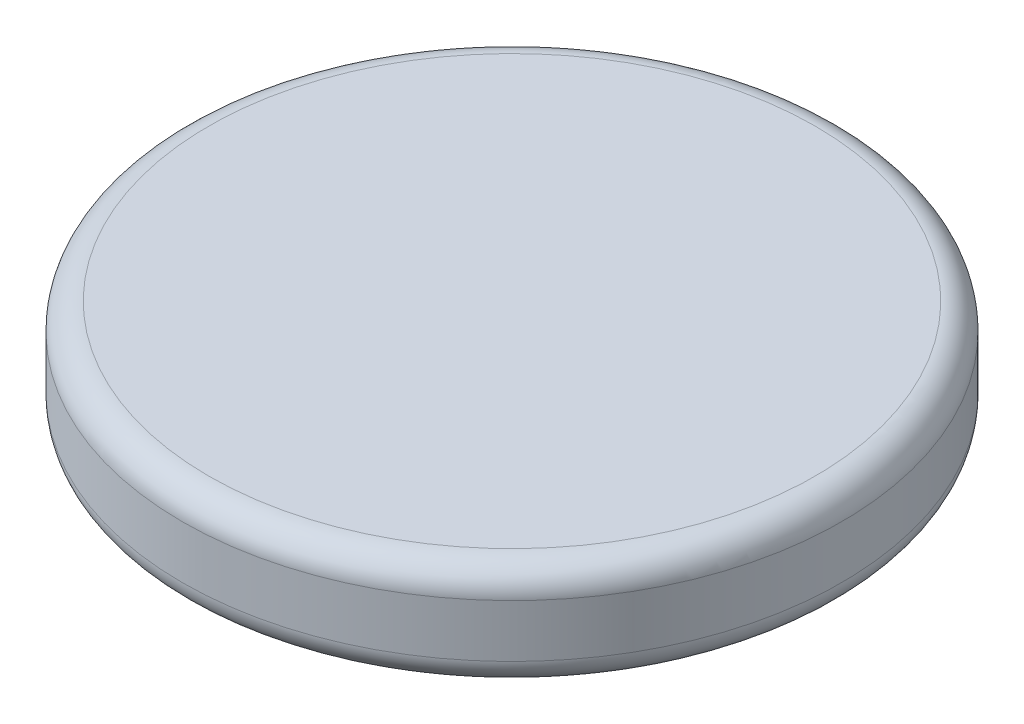
ISO-10303-21;
HEADER;
FILE_DESCRIPTION(('STEP AP214'),'2;1');
FILE_NAME('part.step','',(''),(''),'','','');
FILE_SCHEMA(('AUTOMOTIVE_DESIGN { 1 0 10303 214 1 1 1 1 }'));
ENDSEC;
DATA;
#1=APPLICATION_CONTEXT('core data for automotive mechanical design processes');
#2=APPLICATION_PROTOCOL_DEFINITION('international standard','automotive_design',2000,#1);
#3=PRODUCT_CONTEXT('',#1,'mechanical');
#4=PRODUCT('Part','Part','',(#3));
#5=PRODUCT_RELATED_PRODUCT_CATEGORY('part','',(#4));
#6=PRODUCT_DEFINITION_FORMATION('','',#4);
#7=PRODUCT_DEFINITION_CONTEXT('part definition',#1,'design');
#8=PRODUCT_DEFINITION('design','',#6,#7);
#9=PRODUCT_DEFINITION_SHAPE('','',#8);
#10=(LENGTH_UNIT() NAMED_UNIT(*) SI_UNIT(.MILLI.,.METRE.));
#11=(NAMED_UNIT(*) PLANE_ANGLE_UNIT() SI_UNIT($,.RADIAN.));
#12=(NAMED_UNIT(*) SI_UNIT($,.STERADIAN.) SOLID_ANGLE_UNIT());
#13=UNCERTAINTY_MEASURE_WITH_UNIT(LENGTH_MEASURE(1.E-05),#10,'distance_accuracy_value','');
#14=(GEOMETRIC_REPRESENTATION_CONTEXT(3) GLOBAL_UNCERTAINTY_ASSIGNED_CONTEXT((#13)) GLOBAL_UNIT_ASSIGNED_CONTEXT((#10,
#11,#12)) REPRESENTATION_CONTEXT('',''));
#15=CARTESIAN_POINT('',(0.,0.,0.));
#16=DIRECTION('',(0.,0.,1.));
#17=DIRECTION('',(1.,0.,0.));
#18=AXIS2_PLACEMENT_3D('',#15,#16,#17);
#19=CARTESIAN_POINT('',(0.,-1.2,0.));
#20=DIRECTION('',(0.,1.,0.));
#21=DIRECTION('',(0.,0.,1.));
#22=AXIS2_PLACEMENT_3D('',#19,#20,#21);
#23=PLANE('',#22);
#24=CARTESIAN_POINT('',(0.,-1.2,0.));
#25=DIRECTION('',(0.,1.,0.));
#26=DIRECTION('',(0.,0.,1.));
#27=AXIS2_PLACEMENT_3D('',#24,#25,#26);
#28=CIRCLE('',#27,11.3);
#29=CARTESIAN_POINT('',(0.,-1.2,11.3));
#30=VERTEX_POINT('',#29);
#31=EDGE_CURVE('E250',#30,#30,#28,.T.);
#32=ORIENTED_EDGE('',*,*,#31,.F.);
#33=EDGE_LOOP('',(#32));
#34=FACE_BOUND('',#33,.T.);
#35=DIRECTION('',(0.,0.,-1.));
#36=VECTOR('',#35,1.);
#37=CARTESIAN_POINT('',(-3.1,-1.2,0.));
#38=LINE('',#37,#36);
#39=CARTESIAN_POINT('',(-3.1,-1.2,3.1));
#40=VERTEX_POINT('',#39);
#41=CARTESIAN_POINT('',(-3.1,-1.2,-3.1));
#42=VERTEX_POINT('',#41);
#43=EDGE_CURVE('E260',#40,#42,#38,.T.);
#44=ORIENTED_EDGE('',*,*,#43,.F.);
#45=DIRECTION('',(-1.,0.,0.));
#46=VECTOR('',#45,1.);
#47=CARTESIAN_POINT('',(0.,-1.2,3.1));
#48=LINE('',#47,#46);
#49=CARTESIAN_POINT('',(3.1,-1.2,3.1));
#50=VERTEX_POINT('',#49);
#51=EDGE_CURVE('E253',#50,#40,#48,.T.);
#52=ORIENTED_EDGE('',*,*,#51,.F.);
#53=DIRECTION('',(0.,0.,-1.));
#54=VECTOR('',#53,1.);
#55=CARTESIAN_POINT('',(3.1,-1.2,0.));
#56=LINE('',#55,#54);
#57=CARTESIAN_POINT('',(3.1,-1.2,-3.1));
#58=VERTEX_POINT('',#57);
#59=EDGE_CURVE('E256',#50,#58,#56,.T.);
#60=ORIENTED_EDGE('',*,*,#59,.T.);
#61=DIRECTION('',(-1.,0.,0.));
#62=VECTOR('',#61,1.);
#63=CARTESIAN_POINT('',(0.,-1.2,-3.1));
#64=LINE('',#63,#62);
#65=EDGE_CURVE('E258',#58,#42,#64,.T.);
#66=ORIENTED_EDGE('',*,*,#65,.T.);
#67=EDGE_LOOP('',(#44,#52,#60,#66));
#68=FACE_BOUND('',#67,.T.);
#69=ADVANCED_FACE('F63',(#34,#68),#23,.F.);
#70=CARTESIAN_POINT('',(0.,-1.2,0.));
#71=DIRECTION('',(0.,1.,0.));
#72=DIRECTION('',(0.,0.,1.));
#73=AXIS2_PLACEMENT_3D('',#70,#71,#72);
#74=CYLINDRICAL_SURFACE('',#73,12.5);
#75=CARTESIAN_POINT('',(0.,-3.,0.));
#76=DIRECTION('',(0.,1.,0.));
#77=DIRECTION('',(0.,0.,1.));
#78=AXIS2_PLACEMENT_3D('',#75,#76,#77);
#79=CIRCLE('',#78,12.5);
#80=CARTESIAN_POINT('',(0.,-3.,12.5));
#81=VERTEX_POINT('',#80);
#82=EDGE_CURVE('E266',#81,#81,#79,.T.);
#83=ORIENTED_EDGE('',*,*,#82,.T.);
#84=EDGE_LOOP('',(#83));
#85=FACE_BOUND('',#84,.T.);
#86=CARTESIAN_POINT('',(0.,-1.,0.));
#87=DIRECTION('',(0.,1.,0.));
#88=DIRECTION('',(0.,0.,1.));
#89=AXIS2_PLACEMENT_3D('',#86,#87,#88);
#90=CIRCLE('',#89,12.5);
#91=CARTESIAN_POINT('',(0.,-1.,12.5));
#92=VERTEX_POINT('',#91);
#93=EDGE_CURVE('E263',#92,#92,#90,.F.);
#94=ORIENTED_EDGE('',*,*,#93,.T.);
#95=EDGE_LOOP('',(#94));
#96=FACE_BOUND('',#95,.T.);
#97=ADVANCED_FACE('F280',(#85,#96),#74,.T.);
#98=CARTESIAN_POINT('',(0.,0.,0.));
#99=DIRECTION('',(0.,1.,0.));
#100=DIRECTION('',(0.,0.,1.));
#101=AXIS2_PLACEMENT_3D('',#98,#99,#100);
#102=PLANE('',#101);
#103=CARTESIAN_POINT('',(0.,0.,0.));
#104=DIRECTION('',(0.,1.,0.));
#105=DIRECTION('',(0.,0.,1.));
#106=AXIS2_PLACEMENT_3D('',#103,#104,#105);
#107=CIRCLE('',#106,11.5);
#108=CARTESIAN_POINT('',(0.,0.,11.5));
#109=VERTEX_POINT('',#108);
#110=EDGE_CURVE('E12',#109,#109,#107,.T.);
#111=ORIENTED_EDGE('',*,*,#110,.T.);
#112=EDGE_LOOP('',(#111));
#113=FACE_BOUND('',#112,.T.);
#114=ADVANCED_FACE('F283',(#113),#102,.T.);
#115=CARTESIAN_POINT('',(0.,-4.,0.));
#116=DIRECTION('',(0.,1.,0.));
#117=DIRECTION('',(0.,0.,1.));
#118=AXIS2_PLACEMENT_3D('',#115,#116,#117);
#119=CYLINDRICAL_SURFACE('',#118,11.3);
#120=CARTESIAN_POINT('',(0.,-4.,0.));
#121=DIRECTION('',(0.,1.,0.));
#122=DIRECTION('',(0.,0.,1.));
#123=AXIS2_PLACEMENT_3D('',#120,#121,#122);
#124=CIRCLE('',#123,11.3);
#125=CARTESIAN_POINT('',(0.,-4.,11.3));
#126=VERTEX_POINT('',#125);
#127=EDGE_CURVE('E239',#126,#126,#124,.T.);
#128=ORIENTED_EDGE('',*,*,#127,.F.);
#129=EDGE_LOOP('',(#128));
#130=FACE_BOUND('',#129,.T.);
#131=ORIENTED_EDGE('',*,*,#31,.T.);
#132=EDGE_LOOP('',(#131));
#133=FACE_BOUND('',#132,.T.);
#134=ADVANCED_FACE('F292',(#130,#133),#119,.F.);
#135=CARTESIAN_POINT('',(0.,-4.,0.));
#136=DIRECTION('',(0.,1.,0.));
#137=DIRECTION('',(0.,0.,1.));
#138=AXIS2_PLACEMENT_3D('',#135,#136,#137);
#139=PLANE('',#138);
#140=CARTESIAN_POINT('',(0.,-4.,0.));
#141=DIRECTION('',(0.,1.,0.));
#142=DIRECTION('',(0.,0.,1.));
#143=AXIS2_PLACEMENT_3D('',#140,#141,#142);
#144=CIRCLE('',#143,11.5);
#145=CARTESIAN_POINT('',(0.,-4.,11.5));
#146=VERTEX_POINT('',#145);
#147=EDGE_CURVE('E71',#146,#146,#144,.F.);
#148=ORIENTED_EDGE('',*,*,#147,.T.);
#149=EDGE_LOOP('',(#148));
#150=FACE_BOUND('',#149,.T.);
#151=ORIENTED_EDGE('',*,*,#127,.T.);
#152=EDGE_LOOP('',(#151));
#153=FACE_BOUND('',#152,.T.);
#154=ADVANCED_FACE('F271',(#150,#153),#139,.F.);
#155=CARTESIAN_POINT('',(-3.1,-2.,0.));
#156=DIRECTION('',(1.,0.,0.));
#157=DIRECTION('',(0.,0.,-1.));
#158=AXIS2_PLACEMENT_3D('',#155,#156,#157);
#159=PLANE('',#158);
#160=DIRECTION('',(0.,1.,0.));
#161=VECTOR('',#160,1.);
#162=CARTESIAN_POINT('',(-3.1,-2.,3.1));
#163=LINE('',#162,#161);
#164=CARTESIAN_POINT('',(-3.1,-5.,3.1));
#165=VERTEX_POINT('',#164);
#166=EDGE_CURVE('E235',#165,#40,#163,.T.);
#167=ORIENTED_EDGE('',*,*,#166,.T.);
#168=ORIENTED_EDGE('',*,*,#43,.T.);
#169=DIRECTION('',(0.,1.,0.));
#170=VECTOR('',#169,1.);
#171=CARTESIAN_POINT('',(-3.1,-2.,-3.1));
#172=LINE('',#171,#170);
#173=CARTESIAN_POINT('',(-3.1,-5.,-3.1));
#174=VERTEX_POINT('',#173);
#175=EDGE_CURVE('E236',#174,#42,#172,.T.);
#176=ORIENTED_EDGE('',*,*,#175,.F.);
#177=DIRECTION('',(0.,0.,-1.));
#178=VECTOR('',#177,1.);
#179=CARTESIAN_POINT('',(-3.1,-5.,0.));
#180=LINE('',#179,#178);
#181=EDGE_CURVE('E226',#165,#174,#180,.T.);
#182=ORIENTED_EDGE('',*,*,#181,.F.);
#183=EDGE_LOOP('',(#167,#168,#176,#182));
#184=FACE_BOUND('',#183,.T.);
#185=ADVANCED_FACE('F309',(#184),#159,.F.);
#186=CARTESIAN_POINT('',(0.,-2.,-3.1));
#187=DIRECTION('',(0.,0.,-1.));
#188=DIRECTION('',(-1.,0.,0.));
#189=AXIS2_PLACEMENT_3D('',#186,#187,#188);
#190=PLANE('',#189);
#191=ORIENTED_EDGE('',*,*,#65,.F.);
#192=DIRECTION('',(0.,1.,0.));
#193=VECTOR('',#192,1.);
#194=CARTESIAN_POINT('',(3.1,-2.,-3.1));
#195=LINE('',#194,#193);
#196=CARTESIAN_POINT('',(3.1,-5.,-3.1));
#197=VERTEX_POINT('',#196);
#198=EDGE_CURVE('E240',#197,#58,#195,.T.);
#199=ORIENTED_EDGE('',*,*,#198,.F.);
#200=DIRECTION('',(-1.,0.,0.));
#201=VECTOR('',#200,1.);
#202=CARTESIAN_POINT('',(0.,-5.,-3.1));
#203=LINE('',#202,#201);
#204=EDGE_CURVE('E218',#197,#174,#203,.T.);
#205=ORIENTED_EDGE('',*,*,#204,.T.);
#206=ORIENTED_EDGE('',*,*,#175,.T.);
#207=EDGE_LOOP('',(#191,#199,#205,#206));
#208=FACE_BOUND('',#207,.T.);
#209=ADVANCED_FACE('F312',(#208),#190,.T.);
#210=CARTESIAN_POINT('',(3.1,-2.,0.));
#211=DIRECTION('',(1.,0.,0.));
#212=DIRECTION('',(0.,0.,-1.));
#213=AXIS2_PLACEMENT_3D('',#210,#211,#212);
#214=PLANE('',#213);
#215=ORIENTED_EDGE('',*,*,#59,.F.);
#216=DIRECTION('',(0.,1.,0.));
#217=VECTOR('',#216,1.);
#218=CARTESIAN_POINT('',(3.1,-2.,3.1));
#219=LINE('',#218,#217);
#220=CARTESIAN_POINT('',(3.1,-5.,3.1));
#221=VERTEX_POINT('',#220);
#222=EDGE_CURVE('E243',#221,#50,#219,.T.);
#223=ORIENTED_EDGE('',*,*,#222,.F.);
#224=DIRECTION('',(0.,0.,-1.));
#225=VECTOR('',#224,1.);
#226=CARTESIAN_POINT('',(3.1,-5.,0.));
#227=LINE('',#226,#225);
#228=EDGE_CURVE('E232',#221,#197,#227,.T.);
#229=ORIENTED_EDGE('',*,*,#228,.T.);
#230=ORIENTED_EDGE('',*,*,#198,.T.);
#231=EDGE_LOOP('',(#215,#223,#229,#230));
#232=FACE_BOUND('',#231,.T.);
#233=ADVANCED_FACE('F317',(#232),#214,.T.);
#234=CARTESIAN_POINT('',(0.,-2.,3.1));
#235=DIRECTION('',(0.,0.,-1.));
#236=DIRECTION('',(-1.,0.,0.));
#237=AXIS2_PLACEMENT_3D('',#234,#235,#236);
#238=PLANE('',#237);
#239=ORIENTED_EDGE('',*,*,#222,.T.);
#240=ORIENTED_EDGE('',*,*,#51,.T.);
#241=ORIENTED_EDGE('',*,*,#166,.F.);
#242=DIRECTION('',(-1.,0.,0.));
#243=VECTOR('',#242,1.);
#244=CARTESIAN_POINT('',(0.,-5.,3.1));
#245=LINE('',#244,#243);
#246=EDGE_CURVE('E229',#221,#165,#245,.T.);
#247=ORIENTED_EDGE('',*,*,#246,.F.);
#248=EDGE_LOOP('',(#239,#240,#241,#247));
#249=FACE_BOUND('',#248,.T.);
#250=ADVANCED_FACE('F314',(#249),#238,.F.);
#251=CARTESIAN_POINT('',(0.,-5.,0.));
#252=DIRECTION('',(0.,-1.,0.));
#253=DIRECTION('',(0.,0.,-1.));
#254=AXIS2_PLACEMENT_3D('',#251,#252,#253);
#255=PLANE('',#254);
#256=ORIENTED_EDGE('',*,*,#204,.F.);
#257=ORIENTED_EDGE('',*,*,#228,.F.);
#258=ORIENTED_EDGE('',*,*,#246,.T.);
#259=ORIENTED_EDGE('',*,*,#181,.T.);
#260=EDGE_LOOP('',(#256,#257,#258,#259));
#261=FACE_BOUND('',#260,.T.);
#262=DIRECTION('',(0.,0.,-1.));
#263=VECTOR('',#262,1.);
#264=CARTESIAN_POINT('',(-1.7,-5.,-1.7));
#265=LINE('',#264,#263);
#266=CARTESIAN_POINT('',(-1.7,-5.,1.7));
#267=VERTEX_POINT('',#266);
#268=CARTESIAN_POINT('',(-1.7,-5.,-1.7));
#269=VERTEX_POINT('',#268);
#270=EDGE_CURVE('E160',#267,#269,#265,.T.);
#271=ORIENTED_EDGE('',*,*,#270,.F.);
#272=DIRECTION('',(-1.,0.,0.));
#273=VECTOR('',#272,1.);
#274=CARTESIAN_POINT('',(1.7,-5.,1.7));
#275=LINE('',#274,#273);
#276=CARTESIAN_POINT('',(1.7,-5.,1.7));
#277=VERTEX_POINT('',#276);
#278=EDGE_CURVE('E178',#277,#267,#275,.T.);
#279=ORIENTED_EDGE('',*,*,#278,.F.);
#280=DIRECTION('',(0.,0.,1.));
#281=VECTOR('',#280,1.);
#282=CARTESIAN_POINT('',(1.7,-5.,-1.7));
#283=LINE('',#282,#281);
#284=CARTESIAN_POINT('',(1.7,-5.,-1.7));
#285=VERTEX_POINT('',#284);
#286=EDGE_CURVE('E181',#285,#277,#283,.T.);
#287=ORIENTED_EDGE('',*,*,#286,.F.);
#288=DIRECTION('',(1.,0.,0.));
#289=VECTOR('',#288,1.);
#290=CARTESIAN_POINT('',(1.7,-5.,-1.7));
#291=LINE('',#290,#289);
#292=EDGE_CURVE('E187',#269,#285,#291,.T.);
#293=ORIENTED_EDGE('',*,*,#292,.F.);
#294=EDGE_LOOP('',(#271,#279,#287,#293));
#295=FACE_BOUND('',#294,.T.);
#296=ADVANCED_FACE('F277',(#261,#295),#255,.T.);
#297=CARTESIAN_POINT('',(0.,-3.,0.));
#298=DIRECTION('',(0.,1.,0.));
#299=DIRECTION('',(0.,0.,1.));
#300=AXIS2_PLACEMENT_3D('',#297,#298,#299);
#301=TOROIDAL_SURFACE('',#300,11.5,1.);
#302=ORIENTED_EDGE('',*,*,#147,.F.);
#303=EDGE_LOOP('',(#302));
#304=FACE_BOUND('',#303,.T.);
#305=ORIENTED_EDGE('',*,*,#82,.F.);
#306=EDGE_LOOP('',(#305));
#307=FACE_BOUND('',#306,.T.);
#308=ADVANCED_FACE('F274',(#304,#307),#301,.T.);
#309=CARTESIAN_POINT('',(0.,-1.,0.));
#310=DIRECTION('',(0.,1.,0.));
#311=DIRECTION('',(0.,0.,1.));
#312=AXIS2_PLACEMENT_3D('',#309,#310,#311);
#313=TOROIDAL_SURFACE('',#312,11.5,1.);
#314=ORIENTED_EDGE('',*,*,#93,.F.);
#315=EDGE_LOOP('',(#314));
#316=FACE_BOUND('',#315,.T.);
#317=ORIENTED_EDGE('',*,*,#110,.F.);
#318=EDGE_LOOP('',(#317));
#319=FACE_BOUND('',#318,.T.);
#320=ADVANCED_FACE('F65',(#316,#319),#313,.T.);
#321=CARTESIAN_POINT('',(0.,-4.2,0.));
#322=DIRECTION('',(0.,-1.,0.));
#323=DIRECTION('',(0.,0.,-1.));
#324=AXIS2_PLACEMENT_3D('',#321,#322,#323);
#325=PLANE('',#324);
#326=DIRECTION('',(-1.,0.,0.));
#327=VECTOR('',#326,1.);
#328=CARTESIAN_POINT('',(1.7,-4.2,1.7));
#329=LINE('',#328,#327);
#330=CARTESIAN_POINT('',(1.7,-4.2,1.7));
#331=VERTEX_POINT('',#330);
#332=CARTESIAN_POINT('',(-1.7,-4.2,1.7));
#333=VERTEX_POINT('',#332);
#334=EDGE_CURVE('E165',#331,#333,#329,.T.);
#335=ORIENTED_EDGE('',*,*,#334,.T.);
#336=DIRECTION('',(0.,0.,-1.));
#337=VECTOR('',#336,1.);
#338=CARTESIAN_POINT('',(-1.7,-4.2,-1.7));
#339=LINE('',#338,#337);
#340=CARTESIAN_POINT('',(-1.7,-4.2,-1.7));
#341=VERTEX_POINT('',#340);
#342=EDGE_CURVE('E157',#333,#341,#339,.T.);
#343=ORIENTED_EDGE('',*,*,#342,.T.);
#344=DIRECTION('',(1.,0.,0.));
#345=VECTOR('',#344,1.);
#346=CARTESIAN_POINT('',(1.7,-4.2,-1.7));
#347=LINE('',#346,#345);
#348=CARTESIAN_POINT('',(1.7,-4.2,-1.7));
#349=VERTEX_POINT('',#348);
#350=EDGE_CURVE('E169',#341,#349,#347,.T.);
#351=ORIENTED_EDGE('',*,*,#350,.T.);
#352=DIRECTION('',(0.,0.,1.));
#353=VECTOR('',#352,1.);
#354=CARTESIAN_POINT('',(1.7,-4.2,-1.7));
#355=LINE('',#354,#353);
#356=EDGE_CURVE('E173',#349,#331,#355,.T.);
#357=ORIENTED_EDGE('',*,*,#356,.T.);
#358=EDGE_LOOP('',(#335,#343,#351,#357));
#359=FACE_BOUND('',#358,.T.);
#360=DIRECTION('',(0.,0.,-1.));
#361=VECTOR('',#360,1.);
#362=CARTESIAN_POINT('',(-1.9,-4.2,-1.9));
#363=LINE('',#362,#361);
#364=CARTESIAN_POINT('',(-1.9,-4.2,1.9));
#365=VERTEX_POINT('',#364);
#366=CARTESIAN_POINT('',(-1.9,-4.2,-1.9));
#367=VERTEX_POINT('',#366);
#368=EDGE_CURVE('E193',#365,#367,#363,.T.);
#369=ORIENTED_EDGE('',*,*,#368,.F.);
#370=DIRECTION('',(-1.,0.,0.));
#371=VECTOR('',#370,1.);
#372=CARTESIAN_POINT('',(1.9,-4.2,1.9));
#373=LINE('',#372,#371);
#374=CARTESIAN_POINT('',(1.9,-4.2,1.9));
#375=VERTEX_POINT('',#374);
#376=EDGE_CURVE('E85',#375,#365,#373,.T.);
#377=ORIENTED_EDGE('',*,*,#376,.F.);
#378=DIRECTION('',(0.,0.,1.));
#379=VECTOR('',#378,1.);
#380=CARTESIAN_POINT('',(1.9,-4.2,-1.9));
#381=LINE('',#380,#379);
#382=CARTESIAN_POINT('',(1.9,-4.2,-1.9));
#383=VERTEX_POINT('',#382);
#384=EDGE_CURVE('E78',#383,#375,#381,.T.);
#385=ORIENTED_EDGE('',*,*,#384,.F.);
#386=DIRECTION('',(1.,0.,0.));
#387=VECTOR('',#386,1.);
#388=CARTESIAN_POINT('',(1.9,-4.2,-1.9));
#389=LINE('',#388,#387);
#390=EDGE_CURVE('E199',#367,#383,#389,.T.);
#391=ORIENTED_EDGE('',*,*,#390,.F.);
#392=EDGE_LOOP('',(#369,#377,#385,#391));
#393=FACE_BOUND('',#392,.T.);
#394=ADVANCED_FACE('F175',(#359,#393),#325,.F.);
#395=CARTESIAN_POINT('',(-1.7,-4.2,-1.7));
#396=DIRECTION('',(-1.,0.,0.));
#397=DIRECTION('',(0.,0.,1.));
#398=AXIS2_PLACEMENT_3D('',#395,#396,#397);
#399=PLANE('',#398);
#400=ORIENTED_EDGE('',*,*,#270,.T.);
#401=DIRECTION('',(0.,-1.,0.));
#402=VECTOR('',#401,1.);
#403=CARTESIAN_POINT('',(-1.7,-4.2,-1.7));
#404=LINE('',#403,#402);
#405=EDGE_CURVE('E153',#341,#269,#404,.T.);
#406=ORIENTED_EDGE('',*,*,#405,.F.);
#407=ORIENTED_EDGE('',*,*,#342,.F.);
#408=DIRECTION('',(0.,-1.,0.));
#409=VECTOR('',#408,1.);
#410=CARTESIAN_POINT('',(-1.7,-4.2,1.7));
#411=LINE('',#410,#409);
#412=EDGE_CURVE('E191',#333,#267,#411,.T.);
#413=ORIENTED_EDGE('',*,*,#412,.T.);
#414=EDGE_LOOP('',(#400,#406,#407,#413));
#415=FACE_BOUND('',#414,.T.);
#416=ADVANCED_FACE('F155',(#415),#399,.F.);
#417=CARTESIAN_POINT('',(1.7,-4.2,1.7));
#418=DIRECTION('',(0.,0.,1.));
#419=DIRECTION('',(1.,0.,0.));
#420=AXIS2_PLACEMENT_3D('',#417,#418,#419);
#421=PLANE('',#420);
#422=ORIENTED_EDGE('',*,*,#278,.T.);
#423=ORIENTED_EDGE('',*,*,#412,.F.);
#424=ORIENTED_EDGE('',*,*,#334,.F.);
#425=DIRECTION('',(0.,-1.,0.));
#426=VECTOR('',#425,1.);
#427=CARTESIAN_POINT('',(1.7,-4.2,1.7));
#428=LINE('',#427,#426);
#429=EDGE_CURVE('E194',#331,#277,#428,.T.);
#430=ORIENTED_EDGE('',*,*,#429,.T.);
#431=EDGE_LOOP('',(#422,#423,#424,#430));
#432=FACE_BOUND('',#431,.T.);
#433=ADVANCED_FACE('F350',(#432),#421,.F.);
#434=CARTESIAN_POINT('',(1.7,-4.2,-1.7));
#435=DIRECTION('',(1.,0.,0.));
#436=DIRECTION('',(0.,0.,-1.));
#437=AXIS2_PLACEMENT_3D('',#434,#435,#436);
#438=PLANE('',#437);
#439=ORIENTED_EDGE('',*,*,#286,.T.);
#440=ORIENTED_EDGE('',*,*,#429,.F.);
#441=ORIENTED_EDGE('',*,*,#356,.F.);
#442=DIRECTION('',(0.,-1.,0.));
#443=VECTOR('',#442,1.);
#444=CARTESIAN_POINT('',(1.7,-4.2,-1.7));
#445=LINE('',#444,#443);
#446=EDGE_CURVE('E164',#349,#285,#445,.T.);
#447=ORIENTED_EDGE('',*,*,#446,.T.);
#448=EDGE_LOOP('',(#439,#440,#441,#447));
#449=FACE_BOUND('',#448,.T.);
#450=ADVANCED_FACE('F353',(#449),#438,.F.);
#451=CARTESIAN_POINT('',(1.7,-4.2,-1.7));
#452=DIRECTION('',(0.,0.,-1.));
#453=DIRECTION('',(-1.,0.,0.));
#454=AXIS2_PLACEMENT_3D('',#451,#452,#453);
#455=PLANE('',#454);
#456=ORIENTED_EDGE('',*,*,#292,.T.);
#457=ORIENTED_EDGE('',*,*,#446,.F.);
#458=ORIENTED_EDGE('',*,*,#350,.F.);
#459=ORIENTED_EDGE('',*,*,#405,.T.);
#460=EDGE_LOOP('',(#456,#457,#458,#459));
#461=FACE_BOUND('',#460,.T.);
#462=ADVANCED_FACE('F170',(#461),#455,.F.);
#463=CARTESIAN_POINT('',(0.,-2.,0.));
#464=DIRECTION('',(0.,1.,0.));
#465=DIRECTION('',(0.,0.,1.));
#466=AXIS2_PLACEMENT_3D('',#463,#464,#465);
#467=PLANE('',#466);
#468=DIRECTION('',(0.,0.,-1.));
#469=VECTOR('',#468,1.);
#470=CARTESIAN_POINT('',(1.9,-2.,0.));
#471=LINE('',#470,#469);
#472=CARTESIAN_POINT('',(1.9,-2.,1.9));
#473=VERTEX_POINT('',#472);
#474=CARTESIAN_POINT('',(1.9,-2.,-1.9));
#475=VERTEX_POINT('',#474);
#476=EDGE_CURVE('E203',#473,#475,#471,.T.);
#477=ORIENTED_EDGE('',*,*,#476,.F.);
#478=DIRECTION('',(-1.,0.,0.));
#479=VECTOR('',#478,1.);
#480=CARTESIAN_POINT('',(0.,-2.,1.9));
#481=LINE('',#480,#479);
#482=CARTESIAN_POINT('',(-1.9,-2.,1.9));
#483=VERTEX_POINT('',#482);
#484=EDGE_CURVE('E212',#473,#483,#481,.T.);
#485=ORIENTED_EDGE('',*,*,#484,.T.);
#486=DIRECTION('',(0.,0.,-1.));
#487=VECTOR('',#486,1.);
#488=CARTESIAN_POINT('',(-1.9,-2.,0.));
#489=LINE('',#488,#487);
#490=CARTESIAN_POINT('',(-1.9,-2.,-1.9));
#491=VERTEX_POINT('',#490);
#492=EDGE_CURVE('E209',#483,#491,#489,.T.);
#493=ORIENTED_EDGE('',*,*,#492,.T.);
#494=DIRECTION('',(-1.,0.,0.));
#495=VECTOR('',#494,1.);
#496=CARTESIAN_POINT('',(0.,-2.,-1.9));
#497=LINE('',#496,#495);
#498=EDGE_CURVE('E206',#475,#491,#497,.T.);
#499=ORIENTED_EDGE('',*,*,#498,.F.);
#500=EDGE_LOOP('',(#477,#485,#493,#499));
#501=FACE_BOUND('',#500,.T.);
#502=ADVANCED_FACE('F325',(#501),#467,.F.);
#503=CARTESIAN_POINT('',(0.,-5.,-1.9));
#504=DIRECTION('',(0.,0.,-1.));
#505=DIRECTION('',(-1.,0.,0.));
#506=AXIS2_PLACEMENT_3D('',#503,#504,#505);
#507=PLANE('',#506);
#508=ORIENTED_EDGE('',*,*,#390,.T.);
#509=DIRECTION('',(0.,1.,0.));
#510=VECTOR('',#509,1.);
#511=CARTESIAN_POINT('',(1.9,-5.,-1.9));
#512=LINE('',#511,#510);
#513=EDGE_CURVE('E215',#383,#475,#512,.T.);
#514=ORIENTED_EDGE('',*,*,#513,.T.);
#515=ORIENTED_EDGE('',*,*,#498,.T.);
#516=DIRECTION('',(0.,1.,0.));
#517=VECTOR('',#516,1.);
#518=CARTESIAN_POINT('',(-1.9,-5.,-1.9));
#519=LINE('',#518,#517);
#520=EDGE_CURVE('E221',#367,#491,#519,.T.);
#521=ORIENTED_EDGE('',*,*,#520,.F.);
#522=EDGE_LOOP('',(#508,#514,#515,#521));
#523=FACE_BOUND('',#522,.T.);
#524=ADVANCED_FACE('F328',(#523),#507,.F.);
#525=CARTESIAN_POINT('',(-1.9,-5.,0.));
#526=DIRECTION('',(1.,0.,0.));
#527=DIRECTION('',(0.,0.,-1.));
#528=AXIS2_PLACEMENT_3D('',#525,#526,#527);
#529=PLANE('',#528);
#530=DIRECTION('',(0.,1.,0.));
#531=VECTOR('',#530,1.);
#532=CARTESIAN_POINT('',(-1.9,-5.,1.9));
#533=LINE('',#532,#531);
#534=EDGE_CURVE('E219',#365,#483,#533,.T.);
#535=ORIENTED_EDGE('',*,*,#534,.F.);
#536=ORIENTED_EDGE('',*,*,#368,.T.);
#537=ORIENTED_EDGE('',*,*,#520,.T.);
#538=ORIENTED_EDGE('',*,*,#492,.F.);
#539=EDGE_LOOP('',(#535,#536,#537,#538));
#540=FACE_BOUND('',#539,.T.);
#541=ADVANCED_FACE('F339',(#540),#529,.T.);
#542=CARTESIAN_POINT('',(0.,-5.,1.9));
#543=DIRECTION('',(0.,0.,-1.));
#544=DIRECTION('',(-1.,0.,0.));
#545=AXIS2_PLACEMENT_3D('',#542,#543,#544);
#546=PLANE('',#545);
#547=DIRECTION('',(0.,1.,0.));
#548=VECTOR('',#547,1.);
#549=CARTESIAN_POINT('',(1.9,-5.,1.9));
#550=LINE('',#549,#548);
#551=EDGE_CURVE('E216',#375,#473,#550,.T.);
#552=ORIENTED_EDGE('',*,*,#551,.F.);
#553=ORIENTED_EDGE('',*,*,#376,.T.);
#554=ORIENTED_EDGE('',*,*,#534,.T.);
#555=ORIENTED_EDGE('',*,*,#484,.F.);
#556=EDGE_LOOP('',(#552,#553,#554,#555));
#557=FACE_BOUND('',#556,.T.);
#558=ADVANCED_FACE('F336',(#557),#546,.T.);
#559=CARTESIAN_POINT('',(1.9,-5.,0.));
#560=DIRECTION('',(1.,0.,0.));
#561=DIRECTION('',(0.,0.,-1.));
#562=AXIS2_PLACEMENT_3D('',#559,#560,#561);
#563=PLANE('',#562);
#564=ORIENTED_EDGE('',*,*,#384,.T.);
#565=ORIENTED_EDGE('',*,*,#551,.T.);
#566=ORIENTED_EDGE('',*,*,#476,.T.);
#567=ORIENTED_EDGE('',*,*,#513,.F.);
#568=EDGE_LOOP('',(#564,#565,#566,#567));
#569=FACE_BOUND('',#568,.T.);
#570=ADVANCED_FACE('F333',(#569),#563,.F.);
#571=CLOSED_SHELL('',(#69,#97,#114,#134,#154,#185,#209,#233,#250,#296,#308,#320,#394,#416,#433,
#450,#462,#502,#524,#541,#558,#570));
#572=MANIFOLD_SOLID_BREP('B2',#571);
#573=ADVANCED_BREP_SHAPE_REPRESENTATION('',(#18,#572),#14);
#574=SHAPE_DEFINITION_REPRESENTATION(#9,#573);
ENDSEC;
END-ISO-10303-21;
